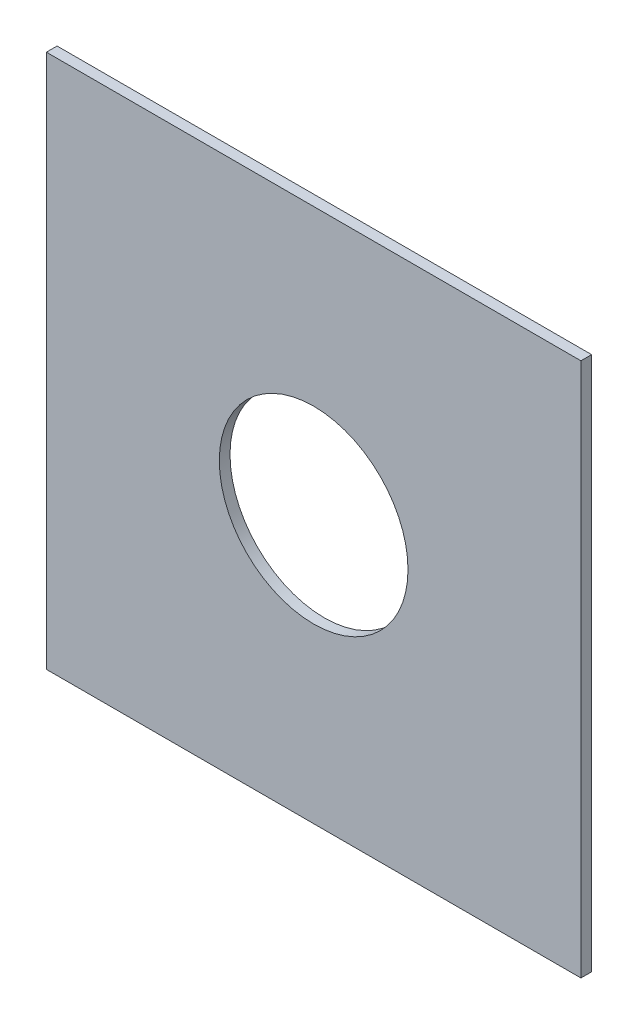
ISO-10303-21;
HEADER;
FILE_DESCRIPTION(('STEP AP214'),'2;1');
FILE_NAME('part.step','',(''),(''),'','','');
FILE_SCHEMA(('AUTOMOTIVE_DESIGN { 1 0 10303 214 1 1 1 1 }'));
ENDSEC;
DATA;
#1=APPLICATION_CONTEXT('core data for automotive mechanical design processes');
#2=APPLICATION_PROTOCOL_DEFINITION('international standard','automotive_design',2000,#1);
#3=PRODUCT_CONTEXT('',#1,'mechanical');
#4=PRODUCT('Part','Part','',(#3));
#5=PRODUCT_RELATED_PRODUCT_CATEGORY('part','',(#4));
#6=PRODUCT_DEFINITION_FORMATION('','',#4);
#7=PRODUCT_DEFINITION_CONTEXT('part definition',#1,'design');
#8=PRODUCT_DEFINITION('design','',#6,#7);
#9=PRODUCT_DEFINITION_SHAPE('','',#8);
#10=(LENGTH_UNIT() NAMED_UNIT(*) SI_UNIT(.MILLI.,.METRE.));
#11=(NAMED_UNIT(*) PLANE_ANGLE_UNIT() SI_UNIT($,.RADIAN.));
#12=(NAMED_UNIT(*) SI_UNIT($,.STERADIAN.) SOLID_ANGLE_UNIT());
#13=UNCERTAINTY_MEASURE_WITH_UNIT(LENGTH_MEASURE(1.E-05),#10,'distance_accuracy_value','');
#14=(GEOMETRIC_REPRESENTATION_CONTEXT(3) GLOBAL_UNCERTAINTY_ASSIGNED_CONTEXT((#13)) GLOBAL_UNIT_ASSIGNED_CONTEXT((#10,
#11,#12)) REPRESENTATION_CONTEXT('',''));
#15=CARTESIAN_POINT('',(0.,0.,0.));
#16=DIRECTION('',(0.,0.,1.));
#17=DIRECTION('',(1.,0.,0.));
#18=AXIS2_PLACEMENT_3D('',#15,#16,#17);
#19=CARTESIAN_POINT('',(0.,0.,10.));
#20=DIRECTION('',(0.,0.,-1.));
#21=DIRECTION('',(-1.,0.,0.));
#22=AXIS2_PLACEMENT_3D('',#19,#20,#21);
#23=PLANE('',#22);
#24=DIRECTION('',(0.,1.,0.));
#25=VECTOR('',#24,1.);
#26=CARTESIAN_POINT('',(250.,-250.,10.));
#27=LINE('',#26,#25);
#28=CARTESIAN_POINT('',(250.,-250.,10.));
#29=VERTEX_POINT('',#28);
#30=CARTESIAN_POINT('',(250.,250.,10.));
#31=VERTEX_POINT('',#30);
#32=EDGE_CURVE('E85',#29,#31,#27,.T.);
#33=ORIENTED_EDGE('',*,*,#32,.T.);
#34=DIRECTION('',(-1.,0.,0.));
#35=VECTOR('',#34,1.);
#36=CARTESIAN_POINT('',(-250.,250.,10.));
#37=LINE('',#36,#35);
#38=CARTESIAN_POINT('',(-250.,250.,10.));
#39=VERTEX_POINT('',#38);
#40=EDGE_CURVE('E80',#31,#39,#37,.T.);
#41=ORIENTED_EDGE('',*,*,#40,.T.);
#42=DIRECTION('',(0.,-1.,0.));
#43=VECTOR('',#42,1.);
#44=CARTESIAN_POINT('',(-250.,-250.,10.));
#45=LINE('',#44,#43);
#46=CARTESIAN_POINT('',(-250.,-250.,10.));
#47=VERTEX_POINT('',#46);
#48=EDGE_CURVE('E83',#39,#47,#45,.T.);
#49=ORIENTED_EDGE('',*,*,#48,.T.);
#50=DIRECTION('',(1.,0.,0.));
#51=VECTOR('',#50,1.);
#52=CARTESIAN_POINT('',(-250.,-250.,10.));
#53=LINE('',#52,#51);
#54=EDGE_CURVE('E50',#47,#29,#53,.T.);
#55=ORIENTED_EDGE('',*,*,#54,.T.);
#56=EDGE_LOOP('',(#33,#41,#49,#55));
#57=FACE_BOUND('',#56,.T.);
#58=CARTESIAN_POINT('',(0.,0.,10.));
#59=DIRECTION('',(0.,0.,1.));
#60=DIRECTION('',(1.,0.,0.));
#61=AXIS2_PLACEMENT_3D('',#58,#59,#60);
#62=CIRCLE('',#61,88.25);
#63=CARTESIAN_POINT('',(88.25,0.,10.));
#64=VERTEX_POINT('',#63);
#65=EDGE_CURVE('E100',#64,#64,#62,.T.);
#66=ORIENTED_EDGE('',*,*,#65,.F.);
#67=EDGE_LOOP('',(#66));
#68=FACE_BOUND('',#67,.T.);
#69=ADVANCED_FACE('F33',(#57,#68),#23,.F.);
#70=CARTESIAN_POINT('',(0.,0.,0.));
#71=DIRECTION('',(0.,0.,-1.));
#72=DIRECTION('',(-1.,0.,0.));
#73=AXIS2_PLACEMENT_3D('',#70,#71,#72);
#74=PLANE('',#73);
#75=DIRECTION('',(0.,1.,0.));
#76=VECTOR('',#75,1.);
#77=CARTESIAN_POINT('',(250.,-250.,0.));
#78=LINE('',#77,#76);
#79=CARTESIAN_POINT('',(250.,-250.,0.));
#80=VERTEX_POINT('',#79);
#81=CARTESIAN_POINT('',(250.,250.,0.));
#82=VERTEX_POINT('',#81);
#83=EDGE_CURVE('E97',#80,#82,#78,.T.);
#84=ORIENTED_EDGE('',*,*,#83,.F.);
#85=DIRECTION('',(1.,0.,0.));
#86=VECTOR('',#85,1.);
#87=CARTESIAN_POINT('',(-250.,-250.,0.));
#88=LINE('',#87,#86);
#89=CARTESIAN_POINT('',(-250.,-250.,0.));
#90=VERTEX_POINT('',#89);
#91=EDGE_CURVE('E73',#90,#80,#88,.T.);
#92=ORIENTED_EDGE('',*,*,#91,.F.);
#93=DIRECTION('',(0.,-1.,0.));
#94=VECTOR('',#93,1.);
#95=CARTESIAN_POINT('',(-250.,-250.,0.));
#96=LINE('',#95,#94);
#97=CARTESIAN_POINT('',(-250.,250.,0.));
#98=VERTEX_POINT('',#97);
#99=EDGE_CURVE('E67',#98,#90,#96,.T.);
#100=ORIENTED_EDGE('',*,*,#99,.F.);
#101=DIRECTION('',(-1.,0.,0.));
#102=VECTOR('',#101,1.);
#103=CARTESIAN_POINT('',(-250.,250.,0.));
#104=LINE('',#103,#102);
#105=EDGE_CURVE('E89',#82,#98,#104,.T.);
#106=ORIENTED_EDGE('',*,*,#105,.F.);
#107=EDGE_LOOP('',(#84,#92,#100,#106));
#108=FACE_BOUND('',#107,.T.);
#109=CARTESIAN_POINT('',(0.,0.,0.));
#110=DIRECTION('',(0.,0.,1.));
#111=DIRECTION('',(1.,0.,0.));
#112=AXIS2_PLACEMENT_3D('',#109,#110,#111);
#113=CIRCLE('',#112,88.25);
#114=CARTESIAN_POINT('',(88.25,0.,0.));
#115=VERTEX_POINT('',#114);
#116=EDGE_CURVE('E112',#115,#115,#113,.T.);
#117=ORIENTED_EDGE('',*,*,#116,.T.);
#118=EDGE_LOOP('',(#117));
#119=FACE_BOUND('',#118,.T.);
#120=ADVANCED_FACE('F108',(#108,#119),#74,.T.);
#121=CARTESIAN_POINT('',(250.,-250.,10.));
#122=DIRECTION('',(-1.,0.,0.));
#123=DIRECTION('',(0.,0.,1.));
#124=AXIS2_PLACEMENT_3D('',#121,#122,#123);
#125=PLANE('',#124);
#126=ORIENTED_EDGE('',*,*,#83,.T.);
#127=DIRECTION('',(0.,0.,-1.));
#128=VECTOR('',#127,1.);
#129=CARTESIAN_POINT('',(250.,250.,10.));
#130=LINE('',#129,#128);
#131=EDGE_CURVE('E11',#31,#82,#130,.T.);
#132=ORIENTED_EDGE('',*,*,#131,.F.);
#133=ORIENTED_EDGE('',*,*,#32,.F.);
#134=DIRECTION('',(0.,0.,-1.));
#135=VECTOR('',#134,1.);
#136=CARTESIAN_POINT('',(250.,-250.,10.));
#137=LINE('',#136,#135);
#138=EDGE_CURVE('E93',#29,#80,#137,.T.);
#139=ORIENTED_EDGE('',*,*,#138,.T.);
#140=EDGE_LOOP('',(#126,#132,#133,#139));
#141=FACE_BOUND('',#140,.T.);
#142=ADVANCED_FACE('F35',(#141),#125,.F.);
#143=CARTESIAN_POINT('',(-250.,250.,10.));
#144=DIRECTION('',(0.,-1.,0.));
#145=DIRECTION('',(0.,0.,-1.));
#146=AXIS2_PLACEMENT_3D('',#143,#144,#145);
#147=PLANE('',#146);
#148=ORIENTED_EDGE('',*,*,#105,.T.);
#149=DIRECTION('',(0.,0.,-1.));
#150=VECTOR('',#149,1.);
#151=CARTESIAN_POINT('',(-250.,250.,10.));
#152=LINE('',#151,#150);
#153=EDGE_CURVE('E42',#39,#98,#152,.T.);
#154=ORIENTED_EDGE('',*,*,#153,.F.);
#155=ORIENTED_EDGE('',*,*,#40,.F.);
#156=ORIENTED_EDGE('',*,*,#131,.T.);
#157=EDGE_LOOP('',(#148,#154,#155,#156));
#158=FACE_BOUND('',#157,.T.);
#159=ADVANCED_FACE('F88',(#158),#147,.F.);
#160=CARTESIAN_POINT('',(-250.,-250.,10.));
#161=DIRECTION('',(1.,0.,0.));
#162=DIRECTION('',(0.,0.,-1.));
#163=AXIS2_PLACEMENT_3D('',#160,#161,#162);
#164=PLANE('',#163);
#165=ORIENTED_EDGE('',*,*,#99,.T.);
#166=DIRECTION('',(0.,0.,-1.));
#167=VECTOR('',#166,1.);
#168=CARTESIAN_POINT('',(-250.,-250.,10.));
#169=LINE('',#168,#167);
#170=EDGE_CURVE('E90',#47,#90,#169,.T.);
#171=ORIENTED_EDGE('',*,*,#170,.F.);
#172=ORIENTED_EDGE('',*,*,#48,.F.);
#173=ORIENTED_EDGE('',*,*,#153,.T.);
#174=EDGE_LOOP('',(#165,#171,#172,#173));
#175=FACE_BOUND('',#174,.T.);
#176=ADVANCED_FACE('F91',(#175),#164,.F.);
#177=CARTESIAN_POINT('',(-250.,-250.,10.));
#178=DIRECTION('',(0.,1.,0.));
#179=DIRECTION('',(0.,0.,1.));
#180=AXIS2_PLACEMENT_3D('',#177,#178,#179);
#181=PLANE('',#180);
#182=ORIENTED_EDGE('',*,*,#91,.T.);
#183=ORIENTED_EDGE('',*,*,#138,.F.);
#184=ORIENTED_EDGE('',*,*,#54,.F.);
#185=ORIENTED_EDGE('',*,*,#170,.T.);
#186=EDGE_LOOP('',(#182,#183,#184,#185));
#187=FACE_BOUND('',#186,.T.);
#188=ADVANCED_FACE('F105',(#187),#181,.F.);
#189=CARTESIAN_POINT('',(0.,0.,10.));
#190=DIRECTION('',(0.,0.,-1.));
#191=DIRECTION('',(-1.,0.,0.));
#192=AXIS2_PLACEMENT_3D('',#189,#190,#191);
#193=CYLINDRICAL_SURFACE('',#192,88.25);
#194=ORIENTED_EDGE('',*,*,#65,.T.);
#195=EDGE_LOOP('',(#194));
#196=FACE_BOUND('',#195,.T.);
#197=ORIENTED_EDGE('',*,*,#116,.F.);
#198=EDGE_LOOP('',(#197));
#199=FACE_BOUND('',#198,.T.);
#200=ADVANCED_FACE('F118',(#196,#199),#193,.F.);
#201=CLOSED_SHELL('',(#69,#120,#142,#159,#176,#188,#200));
#202=MANIFOLD_SOLID_BREP('B2',#201);
#203=ADVANCED_BREP_SHAPE_REPRESENTATION('',(#18,#202),#14);
#204=SHAPE_DEFINITION_REPRESENTATION(#9,#203);
ENDSEC;
END-ISO-10303-21;
